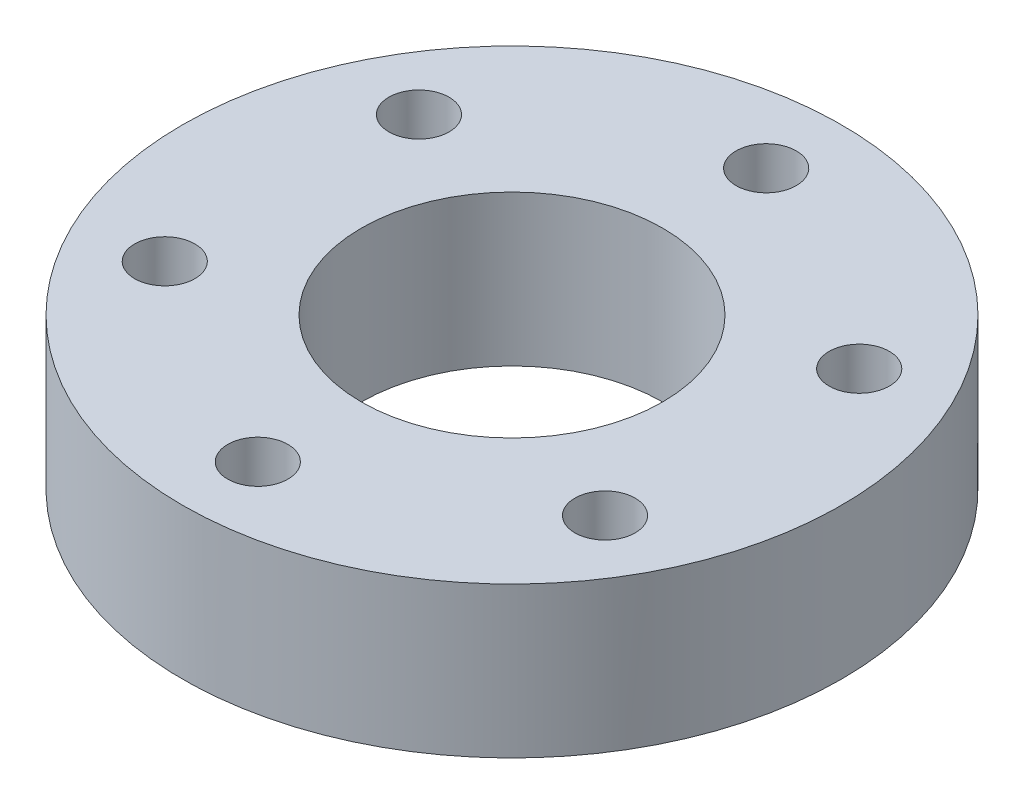
ISO-10303-21;
HEADER;
FILE_DESCRIPTION(('STEP AP214'),'2;1');
FILE_NAME('part.step','',(''),(''),'','','');
FILE_SCHEMA(('AUTOMOTIVE_DESIGN { 1 0 10303 214 1 1 1 1 }'));
ENDSEC;
DATA;
#1=APPLICATION_CONTEXT('core data for automotive mechanical design processes');
#2=APPLICATION_PROTOCOL_DEFINITION('international standard','automotive_design',2000,#1);
#3=PRODUCT_CONTEXT('',#1,'mechanical');
#4=PRODUCT('Part','Part','',(#3));
#5=PRODUCT_RELATED_PRODUCT_CATEGORY('part','',(#4));
#6=PRODUCT_DEFINITION_FORMATION('','',#4);
#7=PRODUCT_DEFINITION_CONTEXT('part definition',#1,'design');
#8=PRODUCT_DEFINITION('design','',#6,#7);
#9=PRODUCT_DEFINITION_SHAPE('','',#8);
#10=(LENGTH_UNIT() NAMED_UNIT(*) SI_UNIT(.MILLI.,.METRE.));
#11=(NAMED_UNIT(*) PLANE_ANGLE_UNIT() SI_UNIT($,.RADIAN.));
#12=(NAMED_UNIT(*) SI_UNIT($,.STERADIAN.) SOLID_ANGLE_UNIT());
#13=UNCERTAINTY_MEASURE_WITH_UNIT(LENGTH_MEASURE(1.E-05),#10,'distance_accuracy_value','');
#14=(GEOMETRIC_REPRESENTATION_CONTEXT(3) GLOBAL_UNCERTAINTY_ASSIGNED_CONTEXT((#13)) GLOBAL_UNIT_ASSIGNED_CONTEXT((#10,
#11,#12)) REPRESENTATION_CONTEXT('',''));
#15=CARTESIAN_POINT('',(0.,0.,0.));
#16=DIRECTION('',(0.,0.,1.));
#17=DIRECTION('',(1.,0.,0.));
#18=AXIS2_PLACEMENT_3D('',#15,#16,#17);
#19=CARTESIAN_POINT('',(-11.6913429510899,2.75,6.75));
#20=DIRECTION('',(0.,1.,0.));
#21=DIRECTION('',(-0.5,0.,-0.866025403784439));
#22=AXIS2_PLACEMENT_3D('',#19,#20,#21);
#23=CYLINDRICAL_SURFACE('',#22,1.6);
#24=DIRECTION('',(0.,-1.,0.));
#25=VECTOR('',#24,1.);
#26=CARTESIAN_POINT('',(-12.4913429510899,2.75,5.3643593539449));
#27=LINE('',#26,#25);
#28=CARTESIAN_POINT('',(-12.49134295109,1.25,5.36435935394472));
#29=VERTEX_POINT('',#28);
#30=CARTESIAN_POINT('',(-12.4913429510899,-2.75,5.3643593539449));
#31=VERTEX_POINT('',#30);
#32=EDGE_CURVE('E60',#29,#31,#27,.T.);
#33=ORIENTED_EDGE('',*,*,#32,.F.);
#34=ORIENTED_EDGE('',*,*,#32,.T.);
#35=CARTESIAN_POINT('',(-11.6913429510899,-2.75,6.75));
#36=DIRECTION('',(0.,1.,0.));
#37=DIRECTION('',(0.5,0.,0.866025403784439));
#38=AXIS2_PLACEMENT_3D('',#35,#36,#37);
#39=CIRCLE('',#38,1.6);
#40=CARTESIAN_POINT('',(-10.8913429510899,-2.75,8.1356406460551));
#41=VERTEX_POINT('',#40);
#42=EDGE_CURVE('E176',#41,#31,#39,.T.);
#43=ORIENTED_EDGE('',*,*,#42,.F.);
#44=DIRECTION('',(0.,-1.,0.));
#45=VECTOR('',#44,1.);
#46=CARTESIAN_POINT('',(-10.8913429510899,2.75,8.1356406460551));
#47=LINE('',#46,#45);
#48=CARTESIAN_POINT('',(-10.8913429510899,1.25,8.1356406460551));
#49=VERTEX_POINT('',#48);
#50=EDGE_CURVE('E11',#49,#41,#47,.T.);
#51=ORIENTED_EDGE('',*,*,#50,.F.);
#52=ORIENTED_EDGE('',*,*,#50,.T.);
#53=CARTESIAN_POINT('',(-11.6913429510899,-2.75,6.75));
#54=DIRECTION('',(0.,1.,0.));
#55=DIRECTION('',(-0.500000000000001,0.,-0.866025403784438));
#56=AXIS2_PLACEMENT_3D('',#53,#54,#55);
#57=CIRCLE('',#56,1.6);
#58=EDGE_CURVE('E302',#31,#41,#57,.T.);
#59=ORIENTED_EDGE('',*,*,#58,.F.);
#60=EDGE_LOOP('',(#33,#34,#43,#51,#52,#59));
#61=FACE_BOUND('',#60,.T.);
#62=CARTESIAN_POINT('',(-11.6913429510908,5.25,6.74999999999856));
#63=DIRECTION('',(0.,1.,0.));
#64=DIRECTION('',(0.,0.,1.));
#65=AXIS2_PLACEMENT_3D('',#62,#63,#64);
#66=CIRCLE('',#65,1.59999999999853);
#67=CARTESIAN_POINT('',(-11.6913429510908,5.25,8.34999999999709));
#68=VERTEX_POINT('',#67);
#69=EDGE_CURVE('E314',#68,#68,#66,.T.);
#70=ORIENTED_EDGE('',*,*,#69,.T.);
#71=EDGE_LOOP('',(#70));
#72=FACE_BOUND('',#71,.T.);
#73=ADVANCED_FACE('F51',(#61,#72),#23,.F.);
#74=CARTESIAN_POINT('',(-11.6913429510899,2.75,-6.75));
#75=DIRECTION('',(0.,1.,0.));
#76=DIRECTION('',(0.5,0.,-0.866025403784438));
#77=AXIS2_PLACEMENT_3D('',#74,#75,#76);
#78=CYLINDRICAL_SURFACE('',#77,1.6);
#79=DIRECTION('',(0.,-1.,0.));
#80=VECTOR('',#79,1.);
#81=CARTESIAN_POINT('',(-10.8913429510899,2.75,-8.1356406460551));
#82=LINE('',#81,#80);
#83=CARTESIAN_POINT('',(-10.8913429510898,1.25,-8.1356406460553));
#84=VERTEX_POINT('',#83);
#85=CARTESIAN_POINT('',(-10.8913429510899,-2.75,-8.1356406460551));
#86=VERTEX_POINT('',#85);
#87=EDGE_CURVE('E206',#84,#86,#82,.T.);
#88=ORIENTED_EDGE('',*,*,#87,.F.);
#89=ORIENTED_EDGE('',*,*,#87,.T.);
#90=CARTESIAN_POINT('',(-11.6913429510899,-2.75,-6.75));
#91=DIRECTION('',(0.,1.,0.));
#92=DIRECTION('',(-0.500000000000001,0.,0.866025403784438));
#93=AXIS2_PLACEMENT_3D('',#90,#91,#92);
#94=CIRCLE('',#93,1.6);
#95=CARTESIAN_POINT('',(-12.4913429510899,-2.75,-5.3643593539449));
#96=VERTEX_POINT('',#95);
#97=EDGE_CURVE('E299',#96,#86,#94,.T.);
#98=ORIENTED_EDGE('',*,*,#97,.F.);
#99=DIRECTION('',(0.,-1.,0.));
#100=VECTOR('',#99,1.);
#101=CARTESIAN_POINT('',(-12.4913429510899,2.75,-5.3643593539449));
#102=LINE('',#101,#100);
#103=CARTESIAN_POINT('',(-12.4913429510899,1.25,-5.3643593539449));
#104=VERTEX_POINT('',#103);
#105=EDGE_CURVE('E71',#104,#96,#102,.T.);
#106=ORIENTED_EDGE('',*,*,#105,.F.);
#107=ORIENTED_EDGE('',*,*,#105,.T.);
#108=CARTESIAN_POINT('',(-11.6913429510899,-2.75,-6.75));
#109=DIRECTION('',(0.,1.,0.));
#110=DIRECTION('',(0.5,0.,-0.866025403784439));
#111=AXIS2_PLACEMENT_3D('',#108,#109,#110);
#112=CIRCLE('',#111,1.6);
#113=EDGE_CURVE('E295',#86,#96,#112,.T.);
#114=ORIENTED_EDGE('',*,*,#113,.F.);
#115=EDGE_LOOP('',(#88,#89,#98,#106,#107,#114));
#116=FACE_BOUND('',#115,.T.);
#117=CARTESIAN_POINT('',(-11.6913429510889,5.25,-6.7500000000018));
#118=DIRECTION('',(0.,1.,0.));
#119=DIRECTION('',(0.,0.,1.));
#120=AXIS2_PLACEMENT_3D('',#117,#118,#119);
#121=CIRCLE('',#120,1.59999999999817);
#122=CARTESIAN_POINT('',(-11.6913429510889,5.25,-5.15000000000363));
#123=VERTEX_POINT('',#122);
#124=EDGE_CURVE('E318',#123,#123,#121,.T.);
#125=ORIENTED_EDGE('',*,*,#124,.T.);
#126=EDGE_LOOP('',(#125));
#127=FACE_BOUND('',#126,.T.);
#128=ADVANCED_FACE('F311',(#116,#127),#78,.F.);
#129=CARTESIAN_POINT('',(0.,2.75,-13.5));
#130=DIRECTION('',(0.,1.,0.));
#131=DIRECTION('',(1.,0.,0.));
#132=AXIS2_PLACEMENT_3D('',#129,#130,#131);
#133=CYLINDRICAL_SURFACE('',#132,1.6);
#134=DIRECTION('',(0.,-1.,0.));
#135=VECTOR('',#134,1.);
#136=CARTESIAN_POINT('',(1.6,2.75,-13.5));
#137=LINE('',#136,#135);
#138=CARTESIAN_POINT('',(1.6,1.25,-13.5));
#139=VERTEX_POINT('',#138);
#140=CARTESIAN_POINT('',(1.6,-2.75,-13.5));
#141=VERTEX_POINT('',#140);
#142=EDGE_CURVE('E203',#139,#141,#137,.T.);
#143=ORIENTED_EDGE('',*,*,#142,.F.);
#144=ORIENTED_EDGE('',*,*,#142,.T.);
#145=CARTESIAN_POINT('',(0.,-2.75,-13.5));
#146=DIRECTION('',(0.,1.,0.));
#147=DIRECTION('',(-1.,0.,0.));
#148=AXIS2_PLACEMENT_3D('',#145,#146,#147);
#149=CIRCLE('',#148,1.6);
#150=CARTESIAN_POINT('',(-1.6,-2.75,-13.5));
#151=VERTEX_POINT('',#150);
#152=EDGE_CURVE('E291',#151,#141,#149,.T.);
#153=ORIENTED_EDGE('',*,*,#152,.F.);
#154=DIRECTION('',(0.,-1.,0.));
#155=VECTOR('',#154,1.);
#156=CARTESIAN_POINT('',(-1.6,2.75,-13.5));
#157=LINE('',#156,#155);
#158=CARTESIAN_POINT('',(-1.6,1.25,-13.5));
#159=VERTEX_POINT('',#158);
#160=EDGE_CURVE('E209',#159,#151,#157,.T.);
#161=ORIENTED_EDGE('',*,*,#160,.F.);
#162=ORIENTED_EDGE('',*,*,#160,.T.);
#163=CARTESIAN_POINT('',(0.,-2.75,-13.5));
#164=DIRECTION('',(0.,1.,0.));
#165=DIRECTION('',(1.,0.,0.));
#166=AXIS2_PLACEMENT_3D('',#163,#164,#165);
#167=CIRCLE('',#166,1.6);
#168=EDGE_CURVE('E287',#141,#151,#167,.T.);
#169=ORIENTED_EDGE('',*,*,#168,.F.);
#170=EDGE_LOOP('',(#143,#144,#153,#161,#162,#169));
#171=FACE_BOUND('',#170,.T.);
#172=CARTESIAN_POINT('',(0.,5.25,-13.5));
#173=DIRECTION('',(0.,1.,0.));
#174=DIRECTION('',(0.,0.,1.));
#175=AXIS2_PLACEMENT_3D('',#172,#173,#174);
#176=CIRCLE('',#175,1.6);
#177=CARTESIAN_POINT('',(0.,5.25,-11.9));
#178=VERTEX_POINT('',#177);
#179=EDGE_CURVE('E335',#178,#178,#176,.T.);
#180=ORIENTED_EDGE('',*,*,#179,.T.);
#181=EDGE_LOOP('',(#180));
#182=FACE_BOUND('',#181,.T.);
#183=ADVANCED_FACE('F372',(#171,#182),#133,.F.);
#184=CARTESIAN_POINT('',(11.6913429510899,2.75,-6.75));
#185=DIRECTION('',(0.,1.,0.));
#186=DIRECTION('',(0.5,0.,0.866025403784439));
#187=AXIS2_PLACEMENT_3D('',#184,#185,#186);
#188=CYLINDRICAL_SURFACE('',#187,1.6);
#189=DIRECTION('',(0.,-1.,0.));
#190=VECTOR('',#189,1.);
#191=CARTESIAN_POINT('',(12.4913429510899,2.75,-5.3643593539449));
#192=LINE('',#191,#190);
#193=CARTESIAN_POINT('',(12.4913429510899,1.25,-5.36435935394485));
#194=VERTEX_POINT('',#193);
#195=CARTESIAN_POINT('',(12.4913429510899,-2.75,-5.3643593539449));
#196=VERTEX_POINT('',#195);
#197=EDGE_CURVE('E194',#194,#196,#192,.T.);
#198=ORIENTED_EDGE('',*,*,#197,.F.);
#199=ORIENTED_EDGE('',*,*,#197,.T.);
#200=CARTESIAN_POINT('',(11.6913429510899,-2.75,-6.75));
#201=DIRECTION('',(0.,1.,0.));
#202=DIRECTION('',(-0.5,0.,-0.866025403784438));
#203=AXIS2_PLACEMENT_3D('',#200,#201,#202);
#204=CIRCLE('',#203,1.6);
#205=CARTESIAN_POINT('',(10.8913429510899,-2.75,-8.1356406460551));
#206=VERTEX_POINT('',#205);
#207=EDGE_CURVE('E283',#206,#196,#204,.T.);
#208=ORIENTED_EDGE('',*,*,#207,.F.);
#209=DIRECTION('',(0.,-1.,0.));
#210=VECTOR('',#209,1.);
#211=CARTESIAN_POINT('',(10.8913429510899,2.75,-8.1356406460551));
#212=LINE('',#211,#210);
#213=CARTESIAN_POINT('',(10.8913429510899,1.25,-8.1356406460551));
#214=VERTEX_POINT('',#213);
#215=EDGE_CURVE('E197',#214,#206,#212,.T.);
#216=ORIENTED_EDGE('',*,*,#215,.F.);
#217=ORIENTED_EDGE('',*,*,#215,.T.);
#218=CARTESIAN_POINT('',(11.6913429510899,-2.75,-6.75));
#219=DIRECTION('',(0.,1.,0.));
#220=DIRECTION('',(0.499999999999998,0.,0.86602540378444));
#221=AXIS2_PLACEMENT_3D('',#218,#219,#220);
#222=CIRCLE('',#221,1.6);
#223=EDGE_CURVE('E279',#196,#206,#222,.T.);
#224=ORIENTED_EDGE('',*,*,#223,.F.);
#225=EDGE_LOOP('',(#198,#199,#208,#216,#217,#224));
#226=FACE_BOUND('',#225,.T.);
#227=CARTESIAN_POINT('',(11.6913429510901,5.25,-6.74999999999964));
#228=DIRECTION('',(0.,1.,0.));
#229=DIRECTION('',(0.,0.,1.));
#230=AXIS2_PLACEMENT_3D('',#227,#228,#229);
#231=CIRCLE('',#230,1.59999999999963);
#232=CARTESIAN_POINT('',(11.6913429510901,5.25,-5.15000000000001));
#233=VERTEX_POINT('',#232);
#234=EDGE_CURVE('E331',#233,#233,#231,.T.);
#235=ORIENTED_EDGE('',*,*,#234,.T.);
#236=EDGE_LOOP('',(#235));
#237=FACE_BOUND('',#236,.T.);
#238=ADVANCED_FACE('F368',(#226,#237),#188,.F.);
#239=CARTESIAN_POINT('',(11.6913429510899,2.75,6.75));
#240=DIRECTION('',(0.,1.,0.));
#241=DIRECTION('',(-0.5,0.,0.866025403784439));
#242=AXIS2_PLACEMENT_3D('',#239,#240,#241);
#243=CYLINDRICAL_SURFACE('',#242,1.6);
#244=DIRECTION('',(0.,-1.,0.));
#245=VECTOR('',#244,1.);
#246=CARTESIAN_POINT('',(10.8913429510899,2.75,8.1356406460551));
#247=LINE('',#246,#245);
#248=CARTESIAN_POINT('',(10.8913429510899,1.25,8.13564064605518));
#249=VERTEX_POINT('',#248);
#250=CARTESIAN_POINT('',(10.8913429510899,-2.75,8.1356406460551));
#251=VERTEX_POINT('',#250);
#252=EDGE_CURVE('E191',#249,#251,#247,.T.);
#253=ORIENTED_EDGE('',*,*,#252,.F.);
#254=ORIENTED_EDGE('',*,*,#252,.T.);
#255=CARTESIAN_POINT('',(11.6913429510899,-2.75,6.75));
#256=DIRECTION('',(0.,1.,0.));
#257=DIRECTION('',(0.5,0.,-0.866025403784439));
#258=AXIS2_PLACEMENT_3D('',#255,#256,#257);
#259=CIRCLE('',#258,1.6);
#260=CARTESIAN_POINT('',(12.4913429510899,-2.75,5.3643593539449));
#261=VERTEX_POINT('',#260);
#262=EDGE_CURVE('E275',#261,#251,#259,.T.);
#263=ORIENTED_EDGE('',*,*,#262,.F.);
#264=DIRECTION('',(0.,-1.,0.));
#265=VECTOR('',#264,1.);
#266=CARTESIAN_POINT('',(12.4913429510899,2.75,5.3643593539449));
#267=LINE('',#266,#265);
#268=CARTESIAN_POINT('',(12.4913429510899,1.25,5.3643593539449));
#269=VERTEX_POINT('',#268);
#270=EDGE_CURVE('E198',#269,#261,#267,.T.);
#271=ORIENTED_EDGE('',*,*,#270,.F.);
#272=ORIENTED_EDGE('',*,*,#270,.T.);
#273=CARTESIAN_POINT('',(11.6913429510899,-2.75,6.75));
#274=DIRECTION('',(0.,1.,0.));
#275=DIRECTION('',(-0.499999999999997,0.,0.86602540378444));
#276=AXIS2_PLACEMENT_3D('',#273,#274,#275);
#277=CIRCLE('',#276,1.6);
#278=EDGE_CURVE('E271',#251,#261,#277,.T.);
#279=ORIENTED_EDGE('',*,*,#278,.F.);
#280=EDGE_LOOP('',(#253,#254,#263,#271,#272,#279));
#281=FACE_BOUND('',#280,.T.);
#282=CARTESIAN_POINT('',(11.6913429510895,5.25,6.75000000000072));
#283=DIRECTION('',(0.,1.,0.));
#284=DIRECTION('',(0.,0.,1.));
#285=AXIS2_PLACEMENT_3D('',#282,#283,#284);
#286=CIRCLE('',#285,1.59999999999927);
#287=CARTESIAN_POINT('',(11.6913429510895,5.25,8.34999999999999));
#288=VERTEX_POINT('',#287);
#289=EDGE_CURVE('E323',#288,#288,#286,.T.);
#290=ORIENTED_EDGE('',*,*,#289,.T.);
#291=EDGE_LOOP('',(#290));
#292=FACE_BOUND('',#291,.T.);
#293=ADVANCED_FACE('F364',(#281,#292),#243,.F.);
#294=CARTESIAN_POINT('',(0.,2.75,13.5));
#295=DIRECTION('',(0.,1.,0.));
#296=DIRECTION('',(-1.,0.,0.));
#297=AXIS2_PLACEMENT_3D('',#294,#295,#296);
#298=CYLINDRICAL_SURFACE('',#297,1.6);
#299=DIRECTION('',(0.,-1.,0.));
#300=VECTOR('',#299,1.);
#301=CARTESIAN_POINT('',(-1.6,2.75,13.5));
#302=LINE('',#301,#300);
#303=CARTESIAN_POINT('',(-1.60000000000015,1.25,13.5));
#304=VERTEX_POINT('',#303);
#305=CARTESIAN_POINT('',(-1.6,-2.75,13.5));
#306=VERTEX_POINT('',#305);
#307=EDGE_CURVE('E183',#304,#306,#302,.T.);
#308=ORIENTED_EDGE('',*,*,#307,.F.);
#309=ORIENTED_EDGE('',*,*,#307,.T.);
#310=CARTESIAN_POINT('',(0.,-2.75,13.5));
#311=DIRECTION('',(0.,1.,0.));
#312=DIRECTION('',(1.,0.,0.));
#313=AXIS2_PLACEMENT_3D('',#310,#311,#312);
#314=CIRCLE('',#313,1.6);
#315=CARTESIAN_POINT('',(1.6,-2.75,13.5));
#316=VERTEX_POINT('',#315);
#317=EDGE_CURVE('E264',#316,#306,#314,.T.);
#318=ORIENTED_EDGE('',*,*,#317,.F.);
#319=DIRECTION('',(0.,-1.,0.));
#320=VECTOR('',#319,1.);
#321=CARTESIAN_POINT('',(1.6,2.75,13.5));
#322=LINE('',#321,#320);
#323=CARTESIAN_POINT('',(1.6,1.25,13.5));
#324=VERTEX_POINT('',#323);
#325=EDGE_CURVE('E186',#324,#316,#322,.T.);
#326=ORIENTED_EDGE('',*,*,#325,.F.);
#327=ORIENTED_EDGE('',*,*,#325,.T.);
#328=CARTESIAN_POINT('',(0.,-2.75,13.5));
#329=DIRECTION('',(0.,1.,0.));
#330=DIRECTION('',(-1.,0.,0.));
#331=AXIS2_PLACEMENT_3D('',#328,#329,#330);
#332=CIRCLE('',#331,1.6);
#333=EDGE_CURVE('E260',#306,#316,#332,.T.);
#334=ORIENTED_EDGE('',*,*,#333,.F.);
#335=EDGE_LOOP('',(#308,#309,#318,#326,#327,#334));
#336=FACE_BOUND('',#335,.T.);
#337=CARTESIAN_POINT('',(-1.24534922808013E-12,5.25,13.5));
#338=DIRECTION('',(0.,1.,0.));
#339=DIRECTION('',(0.,0.,1.));
#340=AXIS2_PLACEMENT_3D('',#337,#338,#339);
#341=CIRCLE('',#340,1.5999999999989);
#342=CARTESIAN_POINT('',(-1.24534922808013E-12,5.25,15.0999999999989));
#343=VERTEX_POINT('',#342);
#344=EDGE_CURVE('E317',#343,#343,#341,.T.);
#345=ORIENTED_EDGE('',*,*,#344,.T.);
#346=EDGE_LOOP('',(#345));
#347=FACE_BOUND('',#346,.T.);
#348=ADVANCED_FACE('F361',(#336,#347),#298,.F.);
#349=CARTESIAN_POINT('',(0.,-2.75,0.));
#350=DIRECTION('',(0.,1.,0.));
#351=DIRECTION('',(-1.,0.,0.));
#352=AXIS2_PLACEMENT_3D('',#349,#350,#351);
#353=CYLINDRICAL_SURFACE('',#352,8.);
#354=DIRECTION('',(0.,1.,0.));
#355=VECTOR('',#354,1.);
#356=CARTESIAN_POINT('',(8.,-2.75,0.));
#357=LINE('',#356,#355);
#358=CARTESIAN_POINT('',(8.,-2.75,0.));
#359=VERTEX_POINT('',#358);
#360=CARTESIAN_POINT('',(8.,1.25,0.));
#361=VERTEX_POINT('',#360);
#362=EDGE_CURVE('E174',#359,#361,#357,.T.);
#363=ORIENTED_EDGE('',*,*,#362,.T.);
#364=ORIENTED_EDGE('',*,*,#362,.F.);
#365=CARTESIAN_POINT('',(0.,-2.75,0.));
#366=DIRECTION('',(0.,-1.,0.));
#367=DIRECTION('',(1.,0.,0.));
#368=AXIS2_PLACEMENT_3D('',#365,#366,#367);
#369=CIRCLE('',#368,8.);
#370=CARTESIAN_POINT('',(-8.,-2.75,0.));
#371=VERTEX_POINT('',#370);
#372=EDGE_CURVE('E254',#359,#371,#369,.T.);
#373=ORIENTED_EDGE('',*,*,#372,.T.);
#374=DIRECTION('',(0.,1.,0.));
#375=VECTOR('',#374,1.);
#376=CARTESIAN_POINT('',(-8.,-2.75,0.));
#377=LINE('',#376,#375);
#378=CARTESIAN_POINT('',(-8.,1.25,0.));
#379=VERTEX_POINT('',#378);
#380=EDGE_CURVE('E169',#371,#379,#377,.T.);
#381=ORIENTED_EDGE('',*,*,#380,.T.);
#382=ORIENTED_EDGE('',*,*,#380,.F.);
#383=CARTESIAN_POINT('',(0.,-2.75,0.));
#384=DIRECTION('',(0.,-1.,0.));
#385=DIRECTION('',(-1.,0.,0.));
#386=AXIS2_PLACEMENT_3D('',#383,#384,#385);
#387=CIRCLE('',#386,8.);
#388=EDGE_CURVE('E250',#371,#359,#387,.T.);
#389=ORIENTED_EDGE('',*,*,#388,.T.);
#390=EDGE_LOOP('',(#363,#364,#373,#381,#382,#389));
#391=FACE_BOUND('',#390,.T.);
#392=CARTESIAN_POINT('',(0.,5.25,0.));
#393=DIRECTION('',(0.,1.,0.));
#394=DIRECTION('',(0.,0.,1.));
#395=AXIS2_PLACEMENT_3D('',#392,#393,#394);
#396=CIRCLE('',#395,8.);
#397=CARTESIAN_POINT('',(0.,5.25,8.));
#398=VERTEX_POINT('',#397);
#399=EDGE_CURVE('E339',#398,#398,#396,.T.);
#400=ORIENTED_EDGE('',*,*,#399,.T.);
#401=EDGE_LOOP('',(#400));
#402=FACE_BOUND('',#401,.T.);
#403=ADVANCED_FACE('F246',(#391,#402),#353,.F.);
#404=CARTESIAN_POINT('',(0.,-2.75,0.));
#405=DIRECTION('',(0.,1.,0.));
#406=DIRECTION('',(-1.,0.,0.));
#407=AXIS2_PLACEMENT_3D('',#404,#405,#406);
#408=CYLINDRICAL_SURFACE('',#407,17.5);
#409=DIRECTION('',(0.,1.,0.));
#410=VECTOR('',#409,1.);
#411=CARTESIAN_POINT('',(17.5,-2.75,0.));
#412=LINE('',#411,#410);
#413=CARTESIAN_POINT('',(17.5,-2.75,0.));
#414=VERTEX_POINT('',#413);
#415=CARTESIAN_POINT('',(17.5,1.25,0.));
#416=VERTEX_POINT('',#415);
#417=EDGE_CURVE('E161',#414,#416,#412,.T.);
#418=ORIENTED_EDGE('',*,*,#417,.T.);
#419=ORIENTED_EDGE('',*,*,#417,.F.);
#420=CARTESIAN_POINT('',(0.,-2.75,0.));
#421=DIRECTION('',(0.,1.,0.));
#422=DIRECTION('',(1.,0.,0.));
#423=AXIS2_PLACEMENT_3D('',#420,#421,#422);
#424=CIRCLE('',#423,17.5);
#425=CARTESIAN_POINT('',(-17.5,-2.75,0.));
#426=VERTEX_POINT('',#425);
#427=EDGE_CURVE('E255',#414,#426,#424,.T.);
#428=ORIENTED_EDGE('',*,*,#427,.T.);
#429=DIRECTION('',(0.,1.,0.));
#430=VECTOR('',#429,1.);
#431=CARTESIAN_POINT('',(-17.5,-2.75,0.));
#432=LINE('',#431,#430);
#433=CARTESIAN_POINT('',(-17.5,1.25,0.));
#434=VERTEX_POINT('',#433);
#435=EDGE_CURVE('E170',#426,#434,#432,.T.);
#436=ORIENTED_EDGE('',*,*,#435,.T.);
#437=ORIENTED_EDGE('',*,*,#435,.F.);
#438=CARTESIAN_POINT('',(0.,-2.75,0.));
#439=DIRECTION('',(0.,1.,0.));
#440=DIRECTION('',(-1.,0.,0.));
#441=AXIS2_PLACEMENT_3D('',#438,#439,#440);
#442=CIRCLE('',#441,17.5);
#443=EDGE_CURVE('E166',#426,#414,#442,.T.);
#444=ORIENTED_EDGE('',*,*,#443,.T.);
#445=EDGE_LOOP('',(#418,#419,#428,#436,#437,#444));
#446=FACE_BOUND('',#445,.T.);
#447=CARTESIAN_POINT('',(0.,5.25,0.));
#448=DIRECTION('',(0.,1.,0.));
#449=DIRECTION('',(0.,0.,1.));
#450=AXIS2_PLACEMENT_3D('',#447,#448,#449);
#451=CIRCLE('',#450,17.5);
#452=CARTESIAN_POINT('',(0.,5.25,17.5));
#453=VERTEX_POINT('',#452);
#454=EDGE_CURVE('E343',#453,#453,#451,.T.);
#455=ORIENTED_EDGE('',*,*,#454,.F.);
#456=EDGE_LOOP('',(#455));
#457=FACE_BOUND('',#456,.T.);
#458=ADVANCED_FACE('F162',(#446,#457),#408,.T.);
#459=CARTESIAN_POINT('',(0.,-2.75,0.));
#460=DIRECTION('',(0.,1.,0.));
#461=DIRECTION('',(-1.,0.,0.));
#462=AXIS2_PLACEMENT_3D('',#459,#460,#461);
#463=PLANE('',#462);
#464=ORIENTED_EDGE('',*,*,#42,.T.);
#465=ORIENTED_EDGE('',*,*,#58,.T.);
#466=EDGE_LOOP('',(#464,#465));
#467=FACE_BOUND('',#466,.T.);
#468=ORIENTED_EDGE('',*,*,#97,.T.);
#469=ORIENTED_EDGE('',*,*,#113,.T.);
#470=EDGE_LOOP('',(#468,#469));
#471=FACE_BOUND('',#470,.T.);
#472=ORIENTED_EDGE('',*,*,#152,.T.);
#473=ORIENTED_EDGE('',*,*,#168,.T.);
#474=EDGE_LOOP('',(#472,#473));
#475=FACE_BOUND('',#474,.T.);
#476=ORIENTED_EDGE('',*,*,#207,.T.);
#477=ORIENTED_EDGE('',*,*,#223,.T.);
#478=EDGE_LOOP('',(#476,#477));
#479=FACE_BOUND('',#478,.T.);
#480=ORIENTED_EDGE('',*,*,#262,.T.);
#481=ORIENTED_EDGE('',*,*,#278,.T.);
#482=EDGE_LOOP('',(#480,#481));
#483=FACE_BOUND('',#482,.T.);
#484=ORIENTED_EDGE('',*,*,#317,.T.);
#485=ORIENTED_EDGE('',*,*,#333,.T.);
#486=EDGE_LOOP('',(#484,#485));
#487=FACE_BOUND('',#486,.T.);
#488=ORIENTED_EDGE('',*,*,#372,.F.);
#489=ORIENTED_EDGE('',*,*,#388,.F.);
#490=EDGE_LOOP('',(#488,#489));
#491=FACE_BOUND('',#490,.T.);
#492=ORIENTED_EDGE('',*,*,#427,.F.);
#493=ORIENTED_EDGE('',*,*,#443,.F.);
#494=EDGE_LOOP('',(#492,#493));
#495=FACE_BOUND('',#494,.T.);
#496=ADVANCED_FACE('F257',(#467,#471,#475,#479,#483,#487,#491,#495),#463,.F.);
#497=CARTESIAN_POINT('',(0.,5.25,0.));
#498=DIRECTION('',(0.,1.,0.));
#499=DIRECTION('',(0.,0.,1.));
#500=AXIS2_PLACEMENT_3D('',#497,#498,#499);
#501=PLANE('',#500);
#502=ORIENTED_EDGE('',*,*,#69,.F.);
#503=EDGE_LOOP('',(#502));
#504=FACE_BOUND('',#503,.T.);
#505=ORIENTED_EDGE('',*,*,#289,.F.);
#506=EDGE_LOOP('',(#505));
#507=FACE_BOUND('',#506,.T.);
#508=ORIENTED_EDGE('',*,*,#179,.F.);
#509=EDGE_LOOP('',(#508));
#510=FACE_BOUND('',#509,.T.);
#511=ORIENTED_EDGE('',*,*,#454,.T.);
#512=EDGE_LOOP('',(#511));
#513=FACE_BOUND('',#512,.T.);
#514=ORIENTED_EDGE('',*,*,#399,.F.);
#515=EDGE_LOOP('',(#514));
#516=FACE_BOUND('',#515,.T.);
#517=ORIENTED_EDGE('',*,*,#234,.F.);
#518=EDGE_LOOP('',(#517));
#519=FACE_BOUND('',#518,.T.);
#520=ORIENTED_EDGE('',*,*,#344,.F.);
#521=EDGE_LOOP('',(#520));
#522=FACE_BOUND('',#521,.T.);
#523=ORIENTED_EDGE('',*,*,#124,.F.);
#524=EDGE_LOOP('',(#523));
#525=FACE_BOUND('',#524,.T.);
#526=ADVANCED_FACE('F350',(#504,#507,#510,#513,#516,#519,#522,#525),#501,.T.);
#527=CLOSED_SHELL('',(#73,#128,#183,#238,#293,#348,#403,#458,#496,#526));
#528=MANIFOLD_SOLID_BREP('B2',#527);
#529=ADVANCED_BREP_SHAPE_REPRESENTATION('',(#18,#528),#14);
#530=SHAPE_DEFINITION_REPRESENTATION(#9,#529);
ENDSEC;
END-ISO-10303-21;
